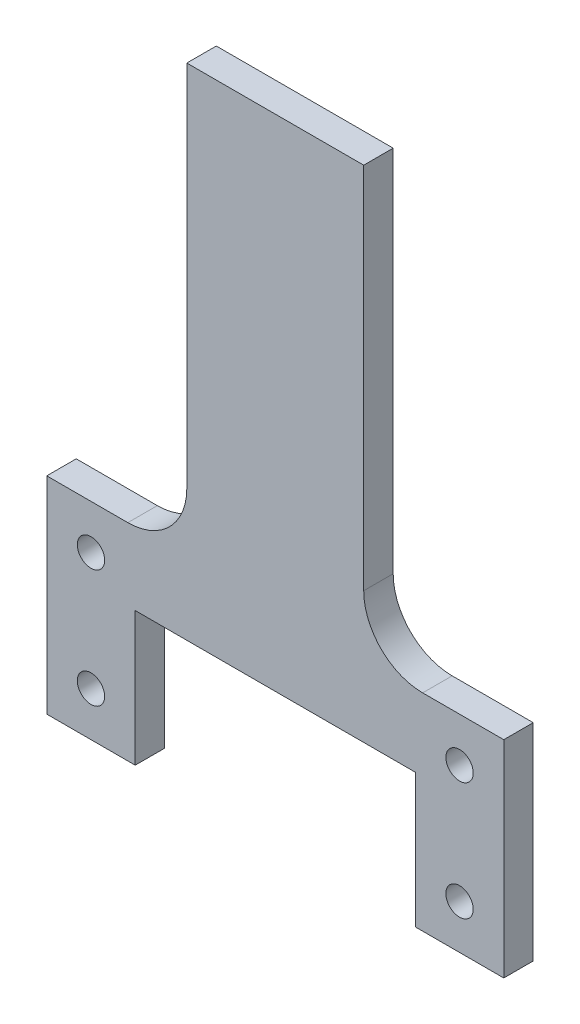
ISO-10303-21;
HEADER;
FILE_DESCRIPTION(('STEP AP214'),'2;1');
FILE_NAME('part.step','',(''),(''),'','','');
FILE_SCHEMA(('AUTOMOTIVE_DESIGN { 1 0 10303 214 1 1 1 1 }'));
ENDSEC;
DATA;
#1=APPLICATION_CONTEXT('core data for automotive mechanical design processes');
#2=APPLICATION_PROTOCOL_DEFINITION('international standard','automotive_design',2000,#1);
#3=PRODUCT_CONTEXT('',#1,'mechanical');
#4=PRODUCT('Part','Part','',(#3));
#5=PRODUCT_RELATED_PRODUCT_CATEGORY('part','',(#4));
#6=PRODUCT_DEFINITION_FORMATION('','',#4);
#7=PRODUCT_DEFINITION_CONTEXT('part definition',#1,'design');
#8=PRODUCT_DEFINITION('design','',#6,#7);
#9=PRODUCT_DEFINITION_SHAPE('','',#8);
#10=(LENGTH_UNIT() NAMED_UNIT(*) SI_UNIT(.MILLI.,.METRE.));
#11=(NAMED_UNIT(*) PLANE_ANGLE_UNIT() SI_UNIT($,.RADIAN.));
#12=(NAMED_UNIT(*) SI_UNIT($,.STERADIAN.) SOLID_ANGLE_UNIT());
#13=UNCERTAINTY_MEASURE_WITH_UNIT(LENGTH_MEASURE(1.E-05),#10,'distance_accuracy_value','');
#14=(GEOMETRIC_REPRESENTATION_CONTEXT(3) GLOBAL_UNCERTAINTY_ASSIGNED_CONTEXT((#13)) GLOBAL_UNIT_ASSIGNED_CONTEXT((#10,
#11,#12)) REPRESENTATION_CONTEXT('',''));
#15=CARTESIAN_POINT('',(0.,0.,0.));
#16=DIRECTION('',(0.,0.,1.));
#17=DIRECTION('',(1.,0.,0.));
#18=AXIS2_PLACEMENT_3D('',#15,#16,#17);
#19=CARTESIAN_POINT('',(-15.08125,-3.0353,3.175));
#20=DIRECTION('',(0.,1.,0.));
#21=DIRECTION('',(-1.,0.,0.));
#22=AXIS2_PLACEMENT_3D('',#19,#20,#21);
#23=PLANE('',#22);
#24=DIRECTION('',(1.,0.,0.));
#25=VECTOR('',#24,1.);
#26=CARTESIAN_POINT('',(-15.08125,-3.0353,0.));
#27=LINE('',#26,#25);
#28=CARTESIAN_POINT('',(-15.08125,-3.0353,0.));
#29=VERTEX_POINT('',#28);
#30=CARTESIAN_POINT('',(15.08125,-3.0353,0.));
#31=VERTEX_POINT('',#30);
#32=EDGE_CURVE('E157',#29,#31,#27,.T.);
#33=ORIENTED_EDGE('',*,*,#32,.T.);
#34=DIRECTION('',(0.,0.,-1.));
#35=VECTOR('',#34,1.);
#36=CARTESIAN_POINT('',(15.08125,-3.0353,3.175));
#37=LINE('',#36,#35);
#38=CARTESIAN_POINT('',(15.08125,-3.0353,3.175));
#39=VERTEX_POINT('',#38);
#40=EDGE_CURVE('E138',#39,#31,#37,.T.);
#41=ORIENTED_EDGE('',*,*,#40,.F.);
#42=DIRECTION('',(1.,0.,0.));
#43=VECTOR('',#42,1.);
#44=CARTESIAN_POINT('',(-15.08125,-3.0353,3.175));
#45=LINE('',#44,#43);
#46=CARTESIAN_POINT('',(-15.08125,-3.0353,3.175));
#47=VERTEX_POINT('',#46);
#48=EDGE_CURVE('E145',#47,#39,#45,.T.);
#49=ORIENTED_EDGE('',*,*,#48,.F.);
#50=DIRECTION('',(0.,0.,-1.));
#51=VECTOR('',#50,1.);
#52=CARTESIAN_POINT('',(-15.08125,-3.0353,3.175));
#53=LINE('',#52,#51);
#54=EDGE_CURVE('E234',#47,#29,#53,.T.);
#55=ORIENTED_EDGE('',*,*,#54,.T.);
#56=EDGE_LOOP('',(#33,#41,#49,#55));
#57=FACE_BOUND('',#56,.T.);
#58=ADVANCED_FACE('F33',(#57),#23,.F.);
#59=CARTESIAN_POINT('',(15.08125,-3.0353,3.175));
#60=DIRECTION('',(1.,0.,0.));
#61=DIRECTION('',(0.,0.,-1.));
#62=AXIS2_PLACEMENT_3D('',#59,#60,#61);
#63=PLANE('',#62);
#64=DIRECTION('',(0.,-1.,0.));
#65=VECTOR('',#64,1.);
#66=CARTESIAN_POINT('',(15.08125,-3.0353,0.));
#67=LINE('',#66,#65);
#68=CARTESIAN_POINT('',(15.08125,-17.4625,0.));
#69=VERTEX_POINT('',#68);
#70=EDGE_CURVE('E257',#31,#69,#67,.T.);
#71=ORIENTED_EDGE('',*,*,#70,.T.);
#72=DIRECTION('',(0.,0.,-1.));
#73=VECTOR('',#72,1.);
#74=CARTESIAN_POINT('',(15.08125,-17.4625,3.175));
#75=LINE('',#74,#73);
#76=CARTESIAN_POINT('',(15.08125,-17.4625,3.175));
#77=VERTEX_POINT('',#76);
#78=EDGE_CURVE('E141',#77,#69,#75,.T.);
#79=ORIENTED_EDGE('',*,*,#78,.F.);
#80=DIRECTION('',(0.,-1.,0.));
#81=VECTOR('',#80,1.);
#82=CARTESIAN_POINT('',(15.08125,-3.0353,3.175));
#83=LINE('',#82,#81);
#84=EDGE_CURVE('E134',#39,#77,#83,.T.);
#85=ORIENTED_EDGE('',*,*,#84,.F.);
#86=ORIENTED_EDGE('',*,*,#40,.T.);
#87=EDGE_LOOP('',(#71,#79,#85,#86));
#88=FACE_BOUND('',#87,.T.);
#89=ADVANCED_FACE('F136',(#88),#63,.F.);
#90=CARTESIAN_POINT('',(15.08125,-17.4625,3.175));
#91=DIRECTION('',(0.,1.,0.));
#92=DIRECTION('',(-1.,0.,0.));
#93=AXIS2_PLACEMENT_3D('',#90,#91,#92);
#94=PLANE('',#93);
#95=DIRECTION('',(1.,0.,0.));
#96=VECTOR('',#95,1.);
#97=CARTESIAN_POINT('',(15.08125,-17.4625,0.));
#98=LINE('',#97,#96);
#99=CARTESIAN_POINT('',(24.60625,-17.4625,0.));
#100=VERTEX_POINT('',#99);
#101=EDGE_CURVE('E220',#69,#100,#98,.T.);
#102=ORIENTED_EDGE('',*,*,#101,.T.);
#103=DIRECTION('',(0.,0.,-1.));
#104=VECTOR('',#103,1.);
#105=CARTESIAN_POINT('',(24.60625,-17.4625,3.175));
#106=LINE('',#105,#104);
#107=CARTESIAN_POINT('',(24.60625,-17.4625,3.175));
#108=VERTEX_POINT('',#107);
#109=EDGE_CURVE('E163',#108,#100,#106,.T.);
#110=ORIENTED_EDGE('',*,*,#109,.F.);
#111=DIRECTION('',(1.,0.,0.));
#112=VECTOR('',#111,1.);
#113=CARTESIAN_POINT('',(15.08125,-17.4625,3.175));
#114=LINE('',#113,#112);
#115=EDGE_CURVE('E144',#77,#108,#114,.T.);
#116=ORIENTED_EDGE('',*,*,#115,.F.);
#117=ORIENTED_EDGE('',*,*,#78,.T.);
#118=EDGE_LOOP('',(#102,#110,#116,#117));
#119=FACE_BOUND('',#118,.T.);
#120=ADVANCED_FACE('F320',(#119),#94,.F.);
#121=CARTESIAN_POINT('',(24.60625,-17.4625,3.175));
#122=DIRECTION('',(-1.,0.,0.));
#123=DIRECTION('',(0.,-1.,0.));
#124=AXIS2_PLACEMENT_3D('',#121,#122,#123);
#125=PLANE('',#124);
#126=DIRECTION('',(0.,1.,0.));
#127=VECTOR('',#126,1.);
#128=CARTESIAN_POINT('',(24.60625,-17.4625,0.));
#129=LINE('',#128,#127);
#130=CARTESIAN_POINT('',(24.60625,4.76250000000001,0.));
#131=VERTEX_POINT('',#130);
#132=EDGE_CURVE('E216',#100,#131,#129,.T.);
#133=ORIENTED_EDGE('',*,*,#132,.T.);
#134=DIRECTION('',(0.,0.,-1.));
#135=VECTOR('',#134,1.);
#136=CARTESIAN_POINT('',(24.60625,4.76250000000001,3.175));
#137=LINE('',#136,#135);
#138=CARTESIAN_POINT('',(24.60625,4.76250000000001,3.175));
#139=VERTEX_POINT('',#138);
#140=EDGE_CURVE('E215',#139,#131,#137,.T.);
#141=ORIENTED_EDGE('',*,*,#140,.F.);
#142=DIRECTION('',(0.,1.,0.));
#143=VECTOR('',#142,1.);
#144=CARTESIAN_POINT('',(24.60625,-17.4625,3.175));
#145=LINE('',#144,#143);
#146=EDGE_CURVE('E254',#108,#139,#145,.T.);
#147=ORIENTED_EDGE('',*,*,#146,.F.);
#148=ORIENTED_EDGE('',*,*,#109,.T.);
#149=EDGE_LOOP('',(#133,#141,#147,#148));
#150=FACE_BOUND('',#149,.T.);
#151=ADVANCED_FACE('F253',(#150),#125,.F.);
#152=CARTESIAN_POINT('',(24.60625,4.76250000000001,3.175));
#153=DIRECTION('',(0.,-1.,0.));
#154=DIRECTION('',(1.,0.,0.));
#155=AXIS2_PLACEMENT_3D('',#152,#153,#154);
#156=PLANE('',#155);
#157=DIRECTION('',(-1.,0.,0.));
#158=VECTOR('',#157,1.);
#159=CARTESIAN_POINT('',(24.60625,4.76250000000001,0.));
#160=LINE('',#159,#158);
#161=CARTESIAN_POINT('',(15.875,4.7625,0.));
#162=VERTEX_POINT('',#161);
#163=EDGE_CURVE('E208',#131,#162,#160,.T.);
#164=ORIENTED_EDGE('',*,*,#163,.T.);
#165=DIRECTION('',(0.,0.,-1.));
#166=VECTOR('',#165,1.);
#167=CARTESIAN_POINT('',(15.875,4.7625,3.175));
#168=LINE('',#167,#166);
#169=CARTESIAN_POINT('',(15.875,4.7625,3.175));
#170=VERTEX_POINT('',#169);
#171=EDGE_CURVE('E161',#162,#170,#168,.F.);
#172=ORIENTED_EDGE('',*,*,#171,.T.);
#173=DIRECTION('',(-1.,0.,0.));
#174=VECTOR('',#173,1.);
#175=CARTESIAN_POINT('',(24.60625,4.76250000000001,3.175));
#176=LINE('',#175,#174);
#177=EDGE_CURVE('E191',#139,#170,#176,.T.);
#178=ORIENTED_EDGE('',*,*,#177,.F.);
#179=ORIENTED_EDGE('',*,*,#140,.T.);
#180=EDGE_LOOP('',(#164,#172,#178,#179));
#181=FACE_BOUND('',#180,.T.);
#182=ADVANCED_FACE('F213',(#181),#156,.F.);
#183=CARTESIAN_POINT('',(9.525,4.7625,3.175));
#184=DIRECTION('',(-1.,0.,0.));
#185=DIRECTION('',(0.,0.,1.));
#186=AXIS2_PLACEMENT_3D('',#183,#184,#185);
#187=PLANE('',#186);
#188=DIRECTION('',(0.,1.,0.));
#189=VECTOR('',#188,1.);
#190=CARTESIAN_POINT('',(9.525,4.7625,3.175));
#191=LINE('',#190,#189);
#192=CARTESIAN_POINT('',(9.525,11.1125,3.175));
#193=VERTEX_POINT('',#192);
#194=CARTESIAN_POINT('',(9.525,50.8,3.175));
#195=VERTEX_POINT('',#194);
#196=EDGE_CURVE('E188',#193,#195,#191,.T.);
#197=ORIENTED_EDGE('',*,*,#196,.F.);
#198=DIRECTION('',(0.,0.,-1.));
#199=VECTOR('',#198,1.);
#200=CARTESIAN_POINT('',(9.525,11.1125,0.));
#201=LINE('',#200,#199);
#202=CARTESIAN_POINT('',(9.525,11.1125,0.));
#203=VERTEX_POINT('',#202);
#204=EDGE_CURVE('E158',#193,#203,#201,.T.);
#205=ORIENTED_EDGE('',*,*,#204,.T.);
#206=DIRECTION('',(0.,1.,0.));
#207=VECTOR('',#206,1.);
#208=CARTESIAN_POINT('',(9.525,4.7625,0.));
#209=LINE('',#208,#207);
#210=CARTESIAN_POINT('',(9.525,50.8,0.));
#211=VERTEX_POINT('',#210);
#212=EDGE_CURVE('E210',#203,#211,#209,.T.);
#213=ORIENTED_EDGE('',*,*,#212,.T.);
#214=DIRECTION('',(0.,0.,-1.));
#215=VECTOR('',#214,1.);
#216=CARTESIAN_POINT('',(9.525,50.8,3.175));
#217=LINE('',#216,#215);
#218=EDGE_CURVE('E199',#195,#211,#217,.T.);
#219=ORIENTED_EDGE('',*,*,#218,.F.);
#220=EDGE_LOOP('',(#197,#205,#213,#219));
#221=FACE_BOUND('',#220,.T.);
#222=ADVANCED_FACE('F196',(#221),#187,.F.);
#223=CARTESIAN_POINT('',(-9.525,50.8,3.175));
#224=DIRECTION('',(0.,-1.,0.));
#225=DIRECTION('',(0.,0.,-1.));
#226=AXIS2_PLACEMENT_3D('',#223,#224,#225);
#227=PLANE('',#226);
#228=DIRECTION('',(-1.,0.,0.));
#229=VECTOR('',#228,1.);
#230=CARTESIAN_POINT('',(-9.525,50.8,0.));
#231=LINE('',#230,#229);
#232=CARTESIAN_POINT('',(-9.525,50.8,0.));
#233=VERTEX_POINT('',#232);
#234=EDGE_CURVE('E218',#211,#233,#231,.T.);
#235=ORIENTED_EDGE('',*,*,#234,.T.);
#236=DIRECTION('',(0.,0.,-1.));
#237=VECTOR('',#236,1.);
#238=CARTESIAN_POINT('',(-9.525,50.8,3.175));
#239=LINE('',#238,#237);
#240=CARTESIAN_POINT('',(-9.525,50.8,3.175));
#241=VERTEX_POINT('',#240);
#242=EDGE_CURVE('E245',#241,#233,#239,.T.);
#243=ORIENTED_EDGE('',*,*,#242,.F.);
#244=DIRECTION('',(-1.,0.,0.));
#245=VECTOR('',#244,1.);
#246=CARTESIAN_POINT('',(-9.525,50.8,3.175));
#247=LINE('',#246,#245);
#248=EDGE_CURVE('E201',#195,#241,#247,.T.);
#249=ORIENTED_EDGE('',*,*,#248,.F.);
#250=ORIENTED_EDGE('',*,*,#218,.T.);
#251=EDGE_LOOP('',(#235,#243,#249,#250));
#252=FACE_BOUND('',#251,.T.);
#253=ADVANCED_FACE('F394',(#252),#227,.F.);
#254=CARTESIAN_POINT('',(-9.525,4.7625,3.175));
#255=DIRECTION('',(1.,0.,0.));
#256=DIRECTION('',(0.,0.,-1.));
#257=AXIS2_PLACEMENT_3D('',#254,#255,#256);
#258=PLANE('',#257);
#259=DIRECTION('',(0.,-1.,0.));
#260=VECTOR('',#259,1.);
#261=CARTESIAN_POINT('',(-9.525,4.7625,0.));
#262=LINE('',#261,#260);
#263=CARTESIAN_POINT('',(-9.525,11.1125,0.));
#264=VERTEX_POINT('',#263);
#265=EDGE_CURVE('E225',#233,#264,#262,.T.);
#266=ORIENTED_EDGE('',*,*,#265,.T.);
#267=DIRECTION('',(0.,0.,-1.));
#268=VECTOR('',#267,1.);
#269=CARTESIAN_POINT('',(-9.525,11.1125,3.175));
#270=LINE('',#269,#268);
#271=CARTESIAN_POINT('',(-9.525,11.1125,3.175));
#272=VERTEX_POINT('',#271);
#273=EDGE_CURVE('E48',#264,#272,#270,.F.);
#274=ORIENTED_EDGE('',*,*,#273,.T.);
#275=DIRECTION('',(0.,-1.,0.));
#276=VECTOR('',#275,1.);
#277=CARTESIAN_POINT('',(-9.525,4.7625,3.175));
#278=LINE('',#277,#276);
#279=EDGE_CURVE('E269',#241,#272,#278,.T.);
#280=ORIENTED_EDGE('',*,*,#279,.F.);
#281=ORIENTED_EDGE('',*,*,#242,.T.);
#282=EDGE_LOOP('',(#266,#274,#280,#281));
#283=FACE_BOUND('',#282,.T.);
#284=ADVANCED_FACE('F399',(#283),#258,.F.);
#285=CARTESIAN_POINT('',(-24.60625,4.7625,3.175));
#286=DIRECTION('',(0.,-1.,0.));
#287=DIRECTION('',(0.,0.,-1.));
#288=AXIS2_PLACEMENT_3D('',#285,#286,#287);
#289=PLANE('',#288);
#290=DIRECTION('',(-1.,0.,0.));
#291=VECTOR('',#290,1.);
#292=CARTESIAN_POINT('',(-24.60625,4.7625,3.175));
#293=LINE('',#292,#291);
#294=CARTESIAN_POINT('',(-15.875,4.7625,3.175));
#295=VERTEX_POINT('',#294);
#296=CARTESIAN_POINT('',(-24.60625,4.7625,3.175));
#297=VERTEX_POINT('',#296);
#298=EDGE_CURVE('E267',#295,#297,#293,.T.);
#299=ORIENTED_EDGE('',*,*,#298,.F.);
#300=DIRECTION('',(0.,0.,-1.));
#301=VECTOR('',#300,1.);
#302=CARTESIAN_POINT('',(-15.875,4.7625,0.));
#303=LINE('',#302,#301);
#304=CARTESIAN_POINT('',(-15.875,4.7625,0.));
#305=VERTEX_POINT('',#304);
#306=EDGE_CURVE('E178',#295,#305,#303,.T.);
#307=ORIENTED_EDGE('',*,*,#306,.T.);
#308=DIRECTION('',(-1.,0.,0.));
#309=VECTOR('',#308,1.);
#310=CARTESIAN_POINT('',(-24.60625,4.7625,0.));
#311=LINE('',#310,#309);
#312=CARTESIAN_POINT('',(-24.60625,4.7625,0.));
#313=VERTEX_POINT('',#312);
#314=EDGE_CURVE('E227',#305,#313,#311,.T.);
#315=ORIENTED_EDGE('',*,*,#314,.T.);
#316=DIRECTION('',(0.,0.,-1.));
#317=VECTOR('',#316,1.);
#318=CARTESIAN_POINT('',(-24.60625,4.7625,3.175));
#319=LINE('',#318,#317);
#320=EDGE_CURVE('E242',#297,#313,#319,.T.);
#321=ORIENTED_EDGE('',*,*,#320,.F.);
#322=EDGE_LOOP('',(#299,#307,#315,#321));
#323=FACE_BOUND('',#322,.T.);
#324=ADVANCED_FACE('F386',(#323),#289,.F.);
#325=CARTESIAN_POINT('',(-24.60625,-17.4625,3.175));
#326=DIRECTION('',(1.,0.,0.));
#327=DIRECTION('',(0.,0.,-1.));
#328=AXIS2_PLACEMENT_3D('',#325,#326,#327);
#329=PLANE('',#328);
#330=DIRECTION('',(0.,-1.,0.));
#331=VECTOR('',#330,1.);
#332=CARTESIAN_POINT('',(-24.60625,-17.4625,0.));
#333=LINE('',#332,#331);
#334=CARTESIAN_POINT('',(-24.60625,-17.4625,0.));
#335=VERTEX_POINT('',#334);
#336=EDGE_CURVE('E229',#313,#335,#333,.T.);
#337=ORIENTED_EDGE('',*,*,#336,.T.);
#338=DIRECTION('',(0.,0.,-1.));
#339=VECTOR('',#338,1.);
#340=CARTESIAN_POINT('',(-24.60625,-17.4625,3.175));
#341=LINE('',#340,#339);
#342=CARTESIAN_POINT('',(-24.60625,-17.4625,3.175));
#343=VERTEX_POINT('',#342);
#344=EDGE_CURVE('E239',#343,#335,#341,.T.);
#345=ORIENTED_EDGE('',*,*,#344,.F.);
#346=DIRECTION('',(0.,-1.,0.));
#347=VECTOR('',#346,1.);
#348=CARTESIAN_POINT('',(-24.60625,-17.4625,3.175));
#349=LINE('',#348,#347);
#350=EDGE_CURVE('E265',#297,#343,#349,.T.);
#351=ORIENTED_EDGE('',*,*,#350,.F.);
#352=ORIENTED_EDGE('',*,*,#320,.T.);
#353=EDGE_LOOP('',(#337,#345,#351,#352));
#354=FACE_BOUND('',#353,.T.);
#355=ADVANCED_FACE('F376',(#354),#329,.F.);
#356=CARTESIAN_POINT('',(-15.08125,-17.4625,3.175));
#357=DIRECTION('',(0.,1.,0.));
#358=DIRECTION('',(0.,0.,1.));
#359=AXIS2_PLACEMENT_3D('',#356,#357,#358);
#360=PLANE('',#359);
#361=DIRECTION('',(1.,0.,0.));
#362=VECTOR('',#361,1.);
#363=CARTESIAN_POINT('',(-15.08125,-17.4625,0.));
#364=LINE('',#363,#362);
#365=CARTESIAN_POINT('',(-15.08125,-17.4625,0.));
#366=VERTEX_POINT('',#365);
#367=EDGE_CURVE('E231',#335,#366,#364,.T.);
#368=ORIENTED_EDGE('',*,*,#367,.T.);
#369=DIRECTION('',(0.,0.,-1.));
#370=VECTOR('',#369,1.);
#371=CARTESIAN_POINT('',(-15.08125,-17.4625,3.175));
#372=LINE('',#371,#370);
#373=CARTESIAN_POINT('',(-15.08125,-17.4625,3.175));
#374=VERTEX_POINT('',#373);
#375=EDGE_CURVE('E236',#374,#366,#372,.T.);
#376=ORIENTED_EDGE('',*,*,#375,.F.);
#377=DIRECTION('',(1.,0.,0.));
#378=VECTOR('',#377,1.);
#379=CARTESIAN_POINT('',(-15.08125,-17.4625,3.175));
#380=LINE('',#379,#378);
#381=EDGE_CURVE('E263',#343,#374,#380,.T.);
#382=ORIENTED_EDGE('',*,*,#381,.F.);
#383=ORIENTED_EDGE('',*,*,#344,.T.);
#384=EDGE_LOOP('',(#368,#376,#382,#383));
#385=FACE_BOUND('',#384,.T.);
#386=ADVANCED_FACE('F365',(#385),#360,.F.);
#387=CARTESIAN_POINT('',(-15.08125,-3.0353,3.175));
#388=DIRECTION('',(-1.,0.,0.));
#389=DIRECTION('',(0.,-1.,0.));
#390=AXIS2_PLACEMENT_3D('',#387,#388,#389);
#391=PLANE('',#390);
#392=DIRECTION('',(0.,1.,0.));
#393=VECTOR('',#392,1.);
#394=CARTESIAN_POINT('',(-15.08125,-3.0353,0.));
#395=LINE('',#394,#393);
#396=EDGE_CURVE('E154',#366,#29,#395,.T.);
#397=ORIENTED_EDGE('',*,*,#396,.T.);
#398=ORIENTED_EDGE('',*,*,#54,.F.);
#399=DIRECTION('',(0.,1.,0.));
#400=VECTOR('',#399,1.);
#401=CARTESIAN_POINT('',(-15.08125,-3.0353,3.175));
#402=LINE('',#401,#400);
#403=EDGE_CURVE('E150',#374,#47,#402,.T.);
#404=ORIENTED_EDGE('',*,*,#403,.F.);
#405=ORIENTED_EDGE('',*,*,#375,.T.);
#406=EDGE_LOOP('',(#397,#398,#404,#405));
#407=FACE_BOUND('',#406,.T.);
#408=ADVANCED_FACE('F293',(#407),#391,.F.);
#409=CARTESIAN_POINT('',(0.,0.,3.175));
#410=DIRECTION('',(0.,0.,-1.));
#411=DIRECTION('',(-1.,0.,0.));
#412=AXIS2_PLACEMENT_3D('',#409,#410,#411);
#413=PLANE('',#412);
#414=CARTESIAN_POINT('',(-19.84375,0.,3.175));
#415=DIRECTION('',(0.,0.,1.));
#416=DIRECTION('',(1.,0.,0.));
#417=AXIS2_PLACEMENT_3D('',#414,#415,#416);
#418=CIRCLE('',#417,1.4732);
#419=CARTESIAN_POINT('',(-18.37055,0.,3.175));
#420=VERTEX_POINT('',#419);
#421=EDGE_CURVE('E175',#420,#420,#418,.T.);
#422=ORIENTED_EDGE('',*,*,#421,.F.);
#423=EDGE_LOOP('',(#422));
#424=FACE_BOUND('',#423,.T.);
#425=CARTESIAN_POINT('',(19.84375,0.,3.175));
#426=DIRECTION('',(0.,0.,1.));
#427=DIRECTION('',(1.,0.,0.));
#428=AXIS2_PLACEMENT_3D('',#425,#426,#427);
#429=CIRCLE('',#428,1.4732);
#430=CARTESIAN_POINT('',(21.31695,0.,3.175));
#431=VERTEX_POINT('',#430);
#432=EDGE_CURVE('E174',#431,#431,#429,.T.);
#433=ORIENTED_EDGE('',*,*,#432,.F.);
#434=EDGE_LOOP('',(#433));
#435=FACE_BOUND('',#434,.T.);
#436=CARTESIAN_POINT('',(19.84375,-12.7,3.175));
#437=DIRECTION('',(0.,0.,1.));
#438=DIRECTION('',(1.,0.,0.));
#439=AXIS2_PLACEMENT_3D('',#436,#437,#438);
#440=CIRCLE('',#439,1.4732);
#441=CARTESIAN_POINT('',(21.31695,-12.7,3.175));
#442=VERTEX_POINT('',#441);
#443=EDGE_CURVE('E171',#442,#442,#440,.T.);
#444=ORIENTED_EDGE('',*,*,#443,.F.);
#445=EDGE_LOOP('',(#444));
#446=FACE_BOUND('',#445,.T.);
#447=CARTESIAN_POINT('',(-19.84375,-12.7,3.175));
#448=DIRECTION('',(0.,0.,1.));
#449=DIRECTION('',(1.,0.,0.));
#450=AXIS2_PLACEMENT_3D('',#447,#448,#449);
#451=CIRCLE('',#450,1.4732);
#452=CARTESIAN_POINT('',(-18.37055,-12.7,3.175));
#453=VERTEX_POINT('',#452);
#454=EDGE_CURVE('E170',#453,#453,#451,.T.);
#455=ORIENTED_EDGE('',*,*,#454,.F.);
#456=EDGE_LOOP('',(#455));
#457=FACE_BOUND('',#456,.T.);
#458=ORIENTED_EDGE('',*,*,#48,.T.);
#459=ORIENTED_EDGE('',*,*,#84,.T.);
#460=ORIENTED_EDGE('',*,*,#115,.T.);
#461=ORIENTED_EDGE('',*,*,#146,.T.);
#462=ORIENTED_EDGE('',*,*,#177,.T.);
#463=CARTESIAN_POINT('',(15.875,11.1125,3.175));
#464=DIRECTION('',(0.,0.,-1.));
#465=DIRECTION('',(-1.,0.,0.));
#466=AXIS2_PLACEMENT_3D('',#463,#464,#465);
#467=CIRCLE('',#466,6.35);
#468=EDGE_CURVE('E184',#170,#193,#467,.T.);
#469=ORIENTED_EDGE('',*,*,#468,.T.);
#470=ORIENTED_EDGE('',*,*,#196,.T.);
#471=ORIENTED_EDGE('',*,*,#248,.T.);
#472=ORIENTED_EDGE('',*,*,#279,.T.);
#473=CARTESIAN_POINT('',(-15.875,11.1125,3.175));
#474=DIRECTION('',(0.,0.,-1.));
#475=DIRECTION('',(-1.,0.,0.));
#476=AXIS2_PLACEMENT_3D('',#473,#474,#475);
#477=CIRCLE('',#476,6.35);
#478=EDGE_CURVE('E11',#272,#295,#477,.T.);
#479=ORIENTED_EDGE('',*,*,#478,.T.);
#480=ORIENTED_EDGE('',*,*,#298,.T.);
#481=ORIENTED_EDGE('',*,*,#350,.T.);
#482=ORIENTED_EDGE('',*,*,#381,.T.);
#483=ORIENTED_EDGE('',*,*,#403,.T.);
#484=EDGE_LOOP('',(#458,#459,#460,#461,#462,#469,#470,#471,#472,#479,#480,#481,#482,#483));
#485=FACE_BOUND('',#484,.T.);
#486=ADVANCED_FACE('F148',(#424,#435,#446,#457,#485),#413,.F.);
#487=CARTESIAN_POINT('',(0.,0.,0.));
#488=DIRECTION('',(0.,0.,-1.));
#489=DIRECTION('',(-1.,0.,0.));
#490=AXIS2_PLACEMENT_3D('',#487,#488,#489);
#491=PLANE('',#490);
#492=CARTESIAN_POINT('',(-19.84375,0.,0.));
#493=DIRECTION('',(0.,0.,-1.));
#494=DIRECTION('',(-1.,0.,0.));
#495=AXIS2_PLACEMENT_3D('',#492,#493,#494);
#496=CIRCLE('',#495,1.4732);
#497=CARTESIAN_POINT('',(-21.31695,0.,0.));
#498=VERTEX_POINT('',#497);
#499=EDGE_CURVE('E172',#498,#498,#496,.T.);
#500=ORIENTED_EDGE('',*,*,#499,.F.);
#501=EDGE_LOOP('',(#500));
#502=FACE_BOUND('',#501,.T.);
#503=CARTESIAN_POINT('',(19.84375,0.,0.));
#504=DIRECTION('',(0.,0.,-1.));
#505=DIRECTION('',(-1.,0.,0.));
#506=AXIS2_PLACEMENT_3D('',#503,#504,#505);
#507=CIRCLE('',#506,1.4732);
#508=CARTESIAN_POINT('',(18.37055,0.,0.));
#509=VERTEX_POINT('',#508);
#510=EDGE_CURVE('E281',#509,#509,#507,.T.);
#511=ORIENTED_EDGE('',*,*,#510,.F.);
#512=EDGE_LOOP('',(#511));
#513=FACE_BOUND('',#512,.T.);
#514=CARTESIAN_POINT('',(19.84375,-12.7,0.));
#515=DIRECTION('',(0.,0.,-1.));
#516=DIRECTION('',(-1.,0.,0.));
#517=AXIS2_PLACEMENT_3D('',#514,#515,#516);
#518=CIRCLE('',#517,1.4732);
#519=CARTESIAN_POINT('',(18.37055,-12.7,0.));
#520=VERTEX_POINT('',#519);
#521=EDGE_CURVE('E167',#520,#520,#518,.T.);
#522=ORIENTED_EDGE('',*,*,#521,.F.);
#523=EDGE_LOOP('',(#522));
#524=FACE_BOUND('',#523,.T.);
#525=CARTESIAN_POINT('',(-19.84375,-12.7,0.));
#526=DIRECTION('',(0.,0.,-1.));
#527=DIRECTION('',(-1.,0.,0.));
#528=AXIS2_PLACEMENT_3D('',#525,#526,#527);
#529=CIRCLE('',#528,1.4732);
#530=CARTESIAN_POINT('',(-21.31695,-12.7,0.));
#531=VERTEX_POINT('',#530);
#532=EDGE_CURVE('E261',#531,#531,#529,.T.);
#533=ORIENTED_EDGE('',*,*,#532,.F.);
#534=EDGE_LOOP('',(#533));
#535=FACE_BOUND('',#534,.T.);
#536=ORIENTED_EDGE('',*,*,#32,.F.);
#537=ORIENTED_EDGE('',*,*,#396,.F.);
#538=ORIENTED_EDGE('',*,*,#367,.F.);
#539=ORIENTED_EDGE('',*,*,#336,.F.);
#540=ORIENTED_EDGE('',*,*,#314,.F.);
#541=CARTESIAN_POINT('',(-15.875,11.1125,0.));
#542=DIRECTION('',(0.,0.,-1.));
#543=DIRECTION('',(-1.,0.,0.));
#544=AXIS2_PLACEMENT_3D('',#541,#542,#543);
#545=CIRCLE('',#544,6.35);
#546=EDGE_CURVE('E41',#305,#264,#545,.F.);
#547=ORIENTED_EDGE('',*,*,#546,.T.);
#548=ORIENTED_EDGE('',*,*,#265,.F.);
#549=ORIENTED_EDGE('',*,*,#234,.F.);
#550=ORIENTED_EDGE('',*,*,#212,.F.);
#551=CARTESIAN_POINT('',(15.875,11.1125,0.));
#552=DIRECTION('',(0.,0.,-1.));
#553=DIRECTION('',(-1.,0.,0.));
#554=AXIS2_PLACEMENT_3D('',#551,#552,#553);
#555=CIRCLE('',#554,6.35);
#556=EDGE_CURVE('E182',#203,#162,#555,.F.);
#557=ORIENTED_EDGE('',*,*,#556,.T.);
#558=ORIENTED_EDGE('',*,*,#163,.F.);
#559=ORIENTED_EDGE('',*,*,#132,.F.);
#560=ORIENTED_EDGE('',*,*,#101,.F.);
#561=ORIENTED_EDGE('',*,*,#70,.F.);
#562=EDGE_LOOP('',(#536,#537,#538,#539,#540,#547,#548,#549,#550,#557,#558,#559,#560,#561));
#563=FACE_BOUND('',#562,.T.);
#564=ADVANCED_FACE('F206',(#502,#513,#524,#535,#563),#491,.T.);
#565=CARTESIAN_POINT('',(-19.84375,-12.7,3.175));
#566=DIRECTION('',(0.,0.,1.));
#567=DIRECTION('',(1.,0.,0.));
#568=AXIS2_PLACEMENT_3D('',#565,#566,#567);
#569=CYLINDRICAL_SURFACE('',#568,1.4732);
#570=ORIENTED_EDGE('',*,*,#532,.T.);
#571=EDGE_LOOP('',(#570));
#572=FACE_BOUND('',#571,.T.);
#573=ORIENTED_EDGE('',*,*,#454,.T.);
#574=EDGE_LOOP('',(#573));
#575=FACE_BOUND('',#574,.T.);
#576=ADVANCED_FACE('F301',(#572,#575),#569,.F.);
#577=CARTESIAN_POINT('',(19.84375,-12.7,3.175));
#578=DIRECTION('',(0.,0.,1.));
#579=DIRECTION('',(1.,0.,0.));
#580=AXIS2_PLACEMENT_3D('',#577,#578,#579);
#581=CYLINDRICAL_SURFACE('',#580,1.4732);
#582=ORIENTED_EDGE('',*,*,#521,.T.);
#583=EDGE_LOOP('',(#582));
#584=FACE_BOUND('',#583,.T.);
#585=ORIENTED_EDGE('',*,*,#443,.T.);
#586=EDGE_LOOP('',(#585));
#587=FACE_BOUND('',#586,.T.);
#588=ADVANCED_FACE('F303',(#584,#587),#581,.F.);
#589=CARTESIAN_POINT('',(19.84375,0.,3.175));
#590=DIRECTION('',(0.,0.,1.));
#591=DIRECTION('',(1.,0.,0.));
#592=AXIS2_PLACEMENT_3D('',#589,#590,#591);
#593=CYLINDRICAL_SURFACE('',#592,1.4732);
#594=ORIENTED_EDGE('',*,*,#510,.T.);
#595=EDGE_LOOP('',(#594));
#596=FACE_BOUND('',#595,.T.);
#597=ORIENTED_EDGE('',*,*,#432,.T.);
#598=EDGE_LOOP('',(#597));
#599=FACE_BOUND('',#598,.T.);
#600=ADVANCED_FACE('F310',(#596,#599),#593,.F.);
#601=CARTESIAN_POINT('',(-19.84375,0.,3.175));
#602=DIRECTION('',(0.,0.,1.));
#603=DIRECTION('',(1.,0.,0.));
#604=AXIS2_PLACEMENT_3D('',#601,#602,#603);
#605=CYLINDRICAL_SURFACE('',#604,1.4732);
#606=ORIENTED_EDGE('',*,*,#499,.T.);
#607=EDGE_LOOP('',(#606));
#608=FACE_BOUND('',#607,.T.);
#609=ORIENTED_EDGE('',*,*,#421,.T.);
#610=EDGE_LOOP('',(#609));
#611=FACE_BOUND('',#610,.T.);
#612=ADVANCED_FACE('F289',(#608,#611),#605,.F.);
#613=CARTESIAN_POINT('',(15.875,11.1125,3.175));
#614=DIRECTION('',(0.,0.,1.));
#615=DIRECTION('',(1.,0.,0.));
#616=AXIS2_PLACEMENT_3D('',#613,#614,#615);
#617=CYLINDRICAL_SURFACE('',#616,6.35);
#618=ORIENTED_EDGE('',*,*,#468,.F.);
#619=ORIENTED_EDGE('',*,*,#171,.F.);
#620=ORIENTED_EDGE('',*,*,#556,.F.);
#621=ORIENTED_EDGE('',*,*,#204,.F.);
#622=EDGE_LOOP('',(#618,#619,#620,#621));
#623=FACE_BOUND('',#622,.T.);
#624=ADVANCED_FACE('F203',(#623),#617,.F.);
#625=CARTESIAN_POINT('',(-15.875,11.1125,3.175));
#626=DIRECTION('',(0.,0.,1.));
#627=DIRECTION('',(1.,0.,0.));
#628=AXIS2_PLACEMENT_3D('',#625,#626,#627);
#629=CYLINDRICAL_SURFACE('',#628,6.35);
#630=ORIENTED_EDGE('',*,*,#478,.F.);
#631=ORIENTED_EDGE('',*,*,#273,.F.);
#632=ORIENTED_EDGE('',*,*,#546,.F.);
#633=ORIENTED_EDGE('',*,*,#306,.F.);
#634=EDGE_LOOP('',(#630,#631,#632,#633));
#635=FACE_BOUND('',#634,.T.);
#636=ADVANCED_FACE('F35',(#635),#629,.F.);
#637=CLOSED_SHELL('',(#58,#89,#120,#151,#182,#222,#253,#284,#324,#355,#386,#408,#486,#564,#576,
#588,#600,#612,#624,#636));
#638=MANIFOLD_SOLID_BREP('B2',#637);
#639=ADVANCED_BREP_SHAPE_REPRESENTATION('',(#18,#638),#14);
#640=SHAPE_DEFINITION_REPRESENTATION(#9,#639);
ENDSEC;
END-ISO-10303-21;
